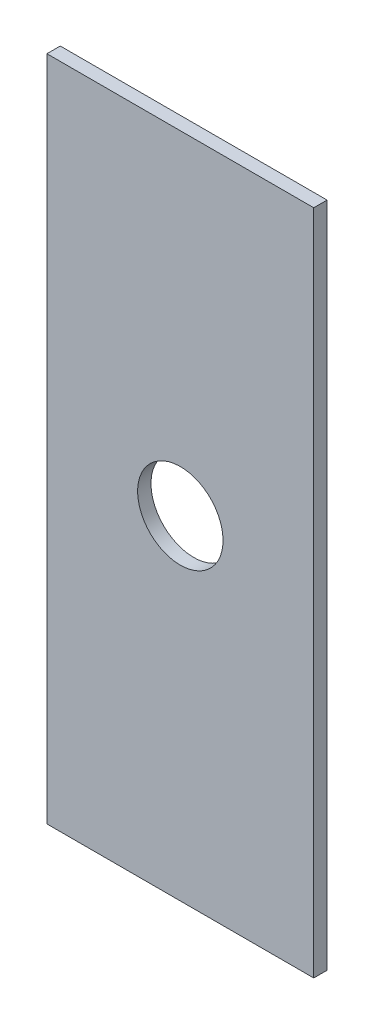
ISO-10303-21;
HEADER;
FILE_DESCRIPTION(('STEP AP214'),'2;1');
FILE_NAME('part.step','',(''),(''),'','','');
FILE_SCHEMA(('AUTOMOTIVE_DESIGN { 1 0 10303 214 1 1 1 1 }'));
ENDSEC;
DATA;
#1=APPLICATION_CONTEXT('core data for automotive mechanical design processes');
#2=APPLICATION_PROTOCOL_DEFINITION('international standard','automotive_design',2000,#1);
#3=PRODUCT_CONTEXT('',#1,'mechanical');
#4=PRODUCT('Part','Part','',(#3));
#5=PRODUCT_RELATED_PRODUCT_CATEGORY('part','',(#4));
#6=PRODUCT_DEFINITION_FORMATION('','',#4);
#7=PRODUCT_DEFINITION_CONTEXT('part definition',#1,'design');
#8=PRODUCT_DEFINITION('design','',#6,#7);
#9=PRODUCT_DEFINITION_SHAPE('','',#8);
#10=(LENGTH_UNIT() NAMED_UNIT(*) SI_UNIT(.MILLI.,.METRE.));
#11=(NAMED_UNIT(*) PLANE_ANGLE_UNIT() SI_UNIT($,.RADIAN.));
#12=(NAMED_UNIT(*) SI_UNIT($,.STERADIAN.) SOLID_ANGLE_UNIT());
#13=UNCERTAINTY_MEASURE_WITH_UNIT(LENGTH_MEASURE(1.E-05),#10,'distance_accuracy_value','');
#14=(GEOMETRIC_REPRESENTATION_CONTEXT(3) GLOBAL_UNCERTAINTY_ASSIGNED_CONTEXT((#13)) GLOBAL_UNIT_ASSIGNED_CONTEXT((#10,
#11,#12)) REPRESENTATION_CONTEXT('',''));
#15=CARTESIAN_POINT('',(0.,0.,0.));
#16=DIRECTION('',(0.,0.,1.));
#17=DIRECTION('',(1.,0.,0.));
#18=AXIS2_PLACEMENT_3D('',#15,#16,#17);
#19=CARTESIAN_POINT('',(0.,0.,3.));
#20=DIRECTION('',(0.,0.,1.));
#21=DIRECTION('',(1.,0.,0.));
#22=AXIS2_PLACEMENT_3D('',#19,#20,#21);
#23=PLANE('',#22);
#24=DIRECTION('',(0.,1.,0.));
#25=VECTOR('',#24,1.);
#26=CARTESIAN_POINT('',(0.834782608695655,12.6391304347826,3.));
#27=LINE('',#26,#25);
#28=CARTESIAN_POINT('',(0.834782608695673,-137.360869565217,3.));
#29=VERTEX_POINT('',#28);
#30=CARTESIAN_POINT('',(0.834782608695655,12.6391304347826,3.));
#31=VERTEX_POINT('',#30);
#32=EDGE_CURVE('E87',#29,#31,#27,.T.);
#33=ORIENTED_EDGE('',*,*,#32,.T.);
#34=DIRECTION('',(-1.,0.,0.));
#35=VECTOR('',#34,1.);
#36=CARTESIAN_POINT('',(-59.1652173913043,12.6391304347826,3.));
#37=LINE('',#36,#35);
#38=CARTESIAN_POINT('',(-59.1652173913043,12.6391304347826,3.));
#39=VERTEX_POINT('',#38);
#40=EDGE_CURVE('E82',#31,#39,#37,.T.);
#41=ORIENTED_EDGE('',*,*,#40,.T.);
#42=DIRECTION('',(0.,-1.,0.));
#43=VECTOR('',#42,1.);
#44=CARTESIAN_POINT('',(-59.1652173913043,12.6391304347826,3.));
#45=LINE('',#44,#43);
#46=CARTESIAN_POINT('',(-59.1652173913043,-137.360869565217,3.));
#47=VERTEX_POINT('',#46);
#48=EDGE_CURVE('E85',#39,#47,#45,.T.);
#49=ORIENTED_EDGE('',*,*,#48,.T.);
#50=DIRECTION('',(1.,0.,0.));
#51=VECTOR('',#50,1.);
#52=CARTESIAN_POINT('',(-59.1652173913043,-137.360869565217,3.));
#53=LINE('',#52,#51);
#54=EDGE_CURVE('E52',#47,#29,#53,.T.);
#55=ORIENTED_EDGE('',*,*,#54,.T.);
#56=EDGE_LOOP('',(#33,#41,#49,#55));
#57=FACE_BOUND('',#56,.T.);
#58=CARTESIAN_POINT('',(-29.1652173913043,-62.3608695652174,3.));
#59=DIRECTION('',(0.,0.,1.));
#60=DIRECTION('',(1.,0.,0.));
#61=AXIS2_PLACEMENT_3D('',#58,#59,#60);
#62=CIRCLE('',#61,9.6);
#63=CARTESIAN_POINT('',(-19.5652173913043,-62.3608695652174,3.));
#64=VERTEX_POINT('',#63);
#65=EDGE_CURVE('E102',#64,#64,#62,.T.);
#66=ORIENTED_EDGE('',*,*,#65,.F.);
#67=EDGE_LOOP('',(#66));
#68=FACE_BOUND('',#67,.T.);
#69=ADVANCED_FACE('F35',(#57,#68),#23,.T.);
#70=CARTESIAN_POINT('',(0.,0.,0.));
#71=DIRECTION('',(0.,0.,1.));
#72=DIRECTION('',(1.,0.,0.));
#73=AXIS2_PLACEMENT_3D('',#70,#71,#72);
#74=PLANE('',#73);
#75=DIRECTION('',(0.,1.,0.));
#76=VECTOR('',#75,1.);
#77=CARTESIAN_POINT('',(0.834782608695655,12.6391304347826,0.));
#78=LINE('',#77,#76);
#79=CARTESIAN_POINT('',(0.834782608695673,-137.360869565217,0.));
#80=VERTEX_POINT('',#79);
#81=CARTESIAN_POINT('',(0.834782608695655,12.6391304347826,0.));
#82=VERTEX_POINT('',#81);
#83=EDGE_CURVE('E99',#80,#82,#78,.T.);
#84=ORIENTED_EDGE('',*,*,#83,.F.);
#85=DIRECTION('',(1.,0.,0.));
#86=VECTOR('',#85,1.);
#87=CARTESIAN_POINT('',(-59.1652173913043,-137.360869565217,0.));
#88=LINE('',#87,#86);
#89=CARTESIAN_POINT('',(-59.1652173913043,-137.360869565217,0.));
#90=VERTEX_POINT('',#89);
#91=EDGE_CURVE('E75',#90,#80,#88,.T.);
#92=ORIENTED_EDGE('',*,*,#91,.F.);
#93=DIRECTION('',(0.,-1.,0.));
#94=VECTOR('',#93,1.);
#95=CARTESIAN_POINT('',(-59.1652173913043,12.6391304347826,0.));
#96=LINE('',#95,#94);
#97=CARTESIAN_POINT('',(-59.1652173913043,12.6391304347826,0.));
#98=VERTEX_POINT('',#97);
#99=EDGE_CURVE('E69',#98,#90,#96,.T.);
#100=ORIENTED_EDGE('',*,*,#99,.F.);
#101=DIRECTION('',(-1.,0.,0.));
#102=VECTOR('',#101,1.);
#103=CARTESIAN_POINT('',(-59.1652173913043,12.6391304347826,0.));
#104=LINE('',#103,#102);
#105=EDGE_CURVE('E91',#82,#98,#104,.T.);
#106=ORIENTED_EDGE('',*,*,#105,.F.);
#107=EDGE_LOOP('',(#84,#92,#100,#106));
#108=FACE_BOUND('',#107,.T.);
#109=CARTESIAN_POINT('',(-29.1652173913043,-62.3608695652174,0.));
#110=DIRECTION('',(0.,0.,1.));
#111=DIRECTION('',(1.,0.,0.));
#112=AXIS2_PLACEMENT_3D('',#109,#110,#111);
#113=CIRCLE('',#112,9.6);
#114=CARTESIAN_POINT('',(-19.5652173913043,-62.3608695652174,0.));
#115=VERTEX_POINT('',#114);
#116=EDGE_CURVE('E114',#115,#115,#113,.T.);
#117=ORIENTED_EDGE('',*,*,#116,.T.);
#118=EDGE_LOOP('',(#117));
#119=FACE_BOUND('',#118,.T.);
#120=ADVANCED_FACE('F110',(#108,#119),#74,.F.);
#121=CARTESIAN_POINT('',(0.834782608695655,12.6391304347826,3.));
#122=DIRECTION('',(-1.,0.,0.));
#123=DIRECTION('',(0.,-1.,0.));
#124=AXIS2_PLACEMENT_3D('',#121,#122,#123);
#125=PLANE('',#124);
#126=ORIENTED_EDGE('',*,*,#83,.T.);
#127=DIRECTION('',(0.,0.,-1.));
#128=VECTOR('',#127,1.);
#129=CARTESIAN_POINT('',(0.834782608695655,12.6391304347826,3.));
#130=LINE('',#129,#128);
#131=EDGE_CURVE('E11',#31,#82,#130,.T.);
#132=ORIENTED_EDGE('',*,*,#131,.F.);
#133=ORIENTED_EDGE('',*,*,#32,.F.);
#134=DIRECTION('',(0.,0.,-1.));
#135=VECTOR('',#134,1.);
#136=CARTESIAN_POINT('',(0.834782608695673,-137.360869565217,3.));
#137=LINE('',#136,#135);
#138=EDGE_CURVE('E95',#29,#80,#137,.T.);
#139=ORIENTED_EDGE('',*,*,#138,.T.);
#140=EDGE_LOOP('',(#126,#132,#133,#139));
#141=FACE_BOUND('',#140,.T.);
#142=ADVANCED_FACE('F37',(#141),#125,.F.);
#143=CARTESIAN_POINT('',(-59.1652173913043,12.6391304347826,3.));
#144=DIRECTION('',(0.,-1.,0.));
#145=DIRECTION('',(0.,0.,-1.));
#146=AXIS2_PLACEMENT_3D('',#143,#144,#145);
#147=PLANE('',#146);
#148=ORIENTED_EDGE('',*,*,#105,.T.);
#149=DIRECTION('',(0.,0.,-1.));
#150=VECTOR('',#149,1.);
#151=CARTESIAN_POINT('',(-59.1652173913043,12.6391304347826,3.));
#152=LINE('',#151,#150);
#153=EDGE_CURVE('E44',#39,#98,#152,.T.);
#154=ORIENTED_EDGE('',*,*,#153,.F.);
#155=ORIENTED_EDGE('',*,*,#40,.F.);
#156=ORIENTED_EDGE('',*,*,#131,.T.);
#157=EDGE_LOOP('',(#148,#154,#155,#156));
#158=FACE_BOUND('',#157,.T.);
#159=ADVANCED_FACE('F90',(#158),#147,.F.);
#160=CARTESIAN_POINT('',(-59.1652173913043,12.6391304347826,3.));
#161=DIRECTION('',(1.,0.,0.));
#162=DIRECTION('',(0.,1.,0.));
#163=AXIS2_PLACEMENT_3D('',#160,#161,#162);
#164=PLANE('',#163);
#165=ORIENTED_EDGE('',*,*,#99,.T.);
#166=DIRECTION('',(0.,0.,-1.));
#167=VECTOR('',#166,1.);
#168=CARTESIAN_POINT('',(-59.1652173913043,-137.360869565217,3.));
#169=LINE('',#168,#167);
#170=EDGE_CURVE('E92',#47,#90,#169,.T.);
#171=ORIENTED_EDGE('',*,*,#170,.F.);
#172=ORIENTED_EDGE('',*,*,#48,.F.);
#173=ORIENTED_EDGE('',*,*,#153,.T.);
#174=EDGE_LOOP('',(#165,#171,#172,#173));
#175=FACE_BOUND('',#174,.T.);
#176=ADVANCED_FACE('F93',(#175),#164,.F.);
#177=CARTESIAN_POINT('',(-59.1652173913043,-137.360869565217,3.));
#178=DIRECTION('',(0.,1.,0.));
#179=DIRECTION('',(0.,0.,1.));
#180=AXIS2_PLACEMENT_3D('',#177,#178,#179);
#181=PLANE('',#180);
#182=ORIENTED_EDGE('',*,*,#91,.T.);
#183=ORIENTED_EDGE('',*,*,#138,.F.);
#184=ORIENTED_EDGE('',*,*,#54,.F.);
#185=ORIENTED_EDGE('',*,*,#170,.T.);
#186=EDGE_LOOP('',(#182,#183,#184,#185));
#187=FACE_BOUND('',#186,.T.);
#188=ADVANCED_FACE('F107',(#187),#181,.F.);
#189=CARTESIAN_POINT('',(-29.1652173913043,-62.3608695652174,3.));
#190=DIRECTION('',(0.,0.,-1.));
#191=DIRECTION('',(-1.,0.,0.));
#192=AXIS2_PLACEMENT_3D('',#189,#190,#191);
#193=CYLINDRICAL_SURFACE('',#192,9.6);
#194=ORIENTED_EDGE('',*,*,#65,.T.);
#195=EDGE_LOOP('',(#194));
#196=FACE_BOUND('',#195,.T.);
#197=ORIENTED_EDGE('',*,*,#116,.F.);
#198=EDGE_LOOP('',(#197));
#199=FACE_BOUND('',#198,.T.);
#200=ADVANCED_FACE('F120',(#196,#199),#193,.F.);
#201=CLOSED_SHELL('',(#69,#120,#142,#159,#176,#188,#200));
#202=MANIFOLD_SOLID_BREP('B2',#201);
#203=ADVANCED_BREP_SHAPE_REPRESENTATION('',(#18,#202),#14);
#204=SHAPE_DEFINITION_REPRESENTATION(#9,#203);
ENDSEC;
END-ISO-10303-21;
